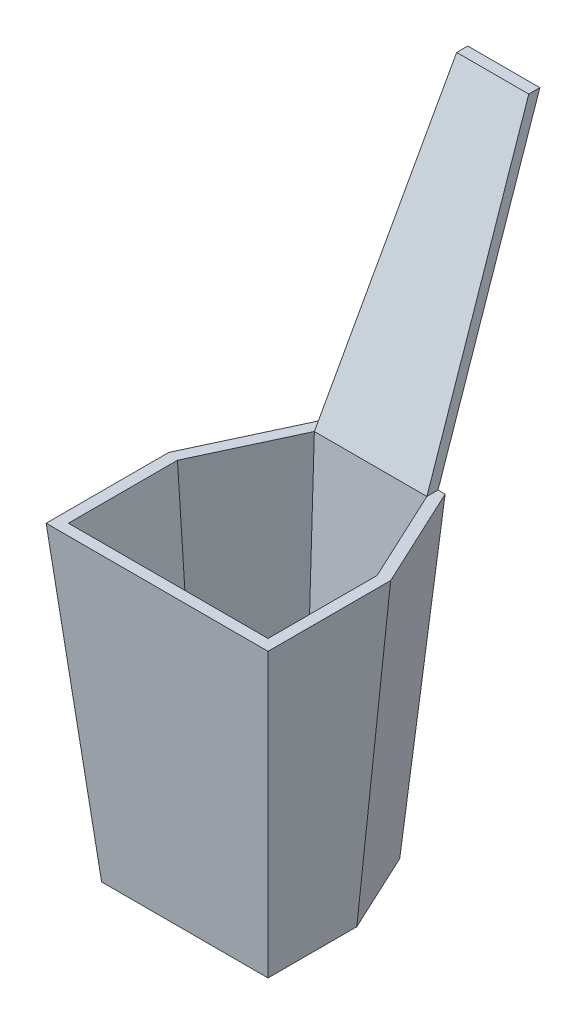
ISO-10303-21;
HEADER;
FILE_DESCRIPTION(('STEP AP214'),'2;1');
FILE_NAME('part.step','',(''),(''),'','','');
FILE_SCHEMA(('AUTOMOTIVE_DESIGN { 1 0 10303 214 1 1 1 1 }'));
ENDSEC;
DATA;
#1=APPLICATION_CONTEXT('core data for automotive mechanical design processes');
#2=APPLICATION_PROTOCOL_DEFINITION('international standard','automotive_design',2000,#1);
#3=PRODUCT_CONTEXT('',#1,'mechanical');
#4=PRODUCT('Part','Part','',(#3));
#5=PRODUCT_RELATED_PRODUCT_CATEGORY('part','',(#4));
#6=PRODUCT_DEFINITION_FORMATION('','',#4);
#7=PRODUCT_DEFINITION_CONTEXT('part definition',#1,'design');
#8=PRODUCT_DEFINITION('design','',#6,#7);
#9=PRODUCT_DEFINITION_SHAPE('','',#8);
#10=(LENGTH_UNIT() NAMED_UNIT(*) SI_UNIT(.MILLI.,.METRE.));
#11=(NAMED_UNIT(*) PLANE_ANGLE_UNIT() SI_UNIT($,.RADIAN.));
#12=(NAMED_UNIT(*) SI_UNIT($,.STERADIAN.) SOLID_ANGLE_UNIT());
#13=UNCERTAINTY_MEASURE_WITH_UNIT(LENGTH_MEASURE(1.E-05),#10,'distance_accuracy_value','');
#14=(GEOMETRIC_REPRESENTATION_CONTEXT(3) GLOBAL_UNCERTAINTY_ASSIGNED_CONTEXT((#13)) GLOBAL_UNIT_ASSIGNED_CONTEXT((#10,
#11,#12)) REPRESENTATION_CONTEXT('',''));
#15=CARTESIAN_POINT('',(0.,0.,0.));
#16=DIRECTION('',(0.,0.,1.));
#17=DIRECTION('',(1.,0.,0.));
#18=AXIS2_PLACEMENT_3D('',#15,#16,#17);
#19=CARTESIAN_POINT('',(0.,71.12,0.));
#20=DIRECTION('',(0.,-1.,0.));
#21=DIRECTION('',(0.,0.,-1.));
#22=AXIS2_PLACEMENT_3D('',#19,#20,#21);
#23=PLANE('',#22);
#24=DIRECTION('',(-0.422618261740697,0.,0.906307787036651));
#25=VECTOR('',#24,1.);
#26=CARTESIAN_POINT('',(-22.9829328482518,71.12,-10.7171175940018));
#27=LINE('',#26,#25);
#28=CARTESIAN_POINT('',(-12.8831974886377,71.12,-32.3760699680097));
#29=VERTEX_POINT('',#28);
#30=CARTESIAN_POINT('',(-22.8498957354249,71.12,-11.0024166031438));
#31=VERTEX_POINT('',#30);
#32=EDGE_CURVE('E208',#29,#31,#27,.T.);
#33=ORIENTED_EDGE('',*,*,#32,.F.);
#34=DIRECTION('',(0.,0.,1.));
#35=VECTOR('',#34,1.);
#36=CARTESIAN_POINT('',(-12.8831974886377,71.12,-32.3760699680097));
#37=LINE('',#36,#35);
#38=CARTESIAN_POINT('',(-12.8831974886377,71.12,-34.9261742325848));
#39=VERTEX_POINT('',#38);
#40=EDGE_CURVE('E170',#39,#29,#37,.T.);
#41=ORIENTED_EDGE('',*,*,#40,.F.);
#42=DIRECTION('',(-1.,0.,0.));
#43=VECTOR('',#42,1.);
#44=CARTESIAN_POINT('',(-14.5077930775568,71.12,-34.9261742325848));
#45=LINE('',#44,#43);
#46=CARTESIAN_POINT('',(-14.5077930775568,71.12,-34.9261742325848));
#47=VERTEX_POINT('',#46);
#48=EDGE_CURVE('E242',#39,#47,#45,.T.);
#49=ORIENTED_EDGE('',*,*,#48,.T.);
#50=DIRECTION('',(-0.422618261740703,0.,0.906307787036648));
#51=VECTOR('',#50,1.);
#52=CARTESIAN_POINT('',(-14.5077930775568,71.12,-34.9261742325848));
#53=LINE('',#52,#51);
#54=CARTESIAN_POINT('',(-25.4,71.12,-11.5677611077835));
#55=VERTEX_POINT('',#54);
#56=EDGE_CURVE('E373',#47,#55,#53,.T.);
#57=ORIENTED_EDGE('',*,*,#56,.T.);
#58=DIRECTION('',(0.,0.,1.));
#59=VECTOR('',#58,1.);
#60=CARTESIAN_POINT('',(-25.4,71.12,16.51));
#61=LINE('',#60,#59);
#62=CARTESIAN_POINT('',(-25.4,71.12,16.51));
#63=VERTEX_POINT('',#62);
#64=EDGE_CURVE('E354',#55,#63,#61,.T.);
#65=ORIENTED_EDGE('',*,*,#64,.T.);
#66=DIRECTION('',(1.,0.,0.));
#67=VECTOR('',#66,1.);
#68=CARTESIAN_POINT('',(25.4,71.12,16.51));
#69=LINE('',#68,#67);
#70=CARTESIAN_POINT('',(25.4,71.12,16.51));
#71=VERTEX_POINT('',#70);
#72=EDGE_CURVE('E483',#63,#71,#69,.T.);
#73=ORIENTED_EDGE('',*,*,#72,.T.);
#74=DIRECTION('',(0.,0.,-1.));
#75=VECTOR('',#74,1.);
#76=CARTESIAN_POINT('',(25.4,71.12,-11.5677611077827));
#77=LINE('',#76,#75);
#78=CARTESIAN_POINT('',(25.4,71.12,-11.5677611077827));
#79=VERTEX_POINT('',#78);
#80=EDGE_CURVE('E487',#71,#79,#77,.T.);
#81=ORIENTED_EDGE('',*,*,#80,.T.);
#82=DIRECTION('',(-0.422618261740691,0.,-0.906307787036654));
#83=VECTOR('',#82,1.);
#84=CARTESIAN_POINT('',(14.5077930775568,71.12,-34.9261742325848));
#85=LINE('',#84,#83);
#86=CARTESIAN_POINT('',(14.5077930775568,71.12,-34.9261742325848));
#87=VERTEX_POINT('',#86);
#88=EDGE_CURVE('E518',#79,#87,#85,.T.);
#89=ORIENTED_EDGE('',*,*,#88,.T.);
#90=CARTESIAN_POINT('',(12.8831974886375,71.12,-34.9261742325848));
#91=VERTEX_POINT('',#90);
#92=EDGE_CURVE('E508',#87,#91,#45,.T.);
#93=ORIENTED_EDGE('',*,*,#92,.T.);
#94=DIRECTION('',(0.,0.,-1.));
#95=VECTOR('',#94,1.);
#96=CARTESIAN_POINT('',(12.8831974886375,71.12,-32.3760699680097));
#97=LINE('',#96,#95);
#98=CARTESIAN_POINT('',(12.8831974886375,71.12,-32.3760699680097));
#99=VERTEX_POINT('',#98);
#100=EDGE_CURVE('E744',#99,#91,#97,.T.);
#101=ORIENTED_EDGE('',*,*,#100,.F.);
#102=DIRECTION('',(-0.422618261740697,0.,-0.906307787036651));
#103=VECTOR('',#102,1.);
#104=CARTESIAN_POINT('',(22.9829328482517,71.12,-10.7171175940018));
#105=LINE('',#104,#103);
#106=CARTESIAN_POINT('',(22.8498957354249,71.12,-11.0024166031434));
#107=VERTEX_POINT('',#106);
#108=EDGE_CURVE('E201',#107,#99,#105,.T.);
#109=ORIENTED_EDGE('',*,*,#108,.F.);
#110=DIRECTION('',(0.,0.,-1.));
#111=VECTOR('',#110,1.);
#112=CARTESIAN_POINT('',(22.8498957354249,71.12,0.));
#113=LINE('',#112,#111);
#114=CARTESIAN_POINT('',(22.8498957354249,71.12,13.9598957354249));
#115=VERTEX_POINT('',#114);
#116=EDGE_CURVE('E236',#115,#107,#113,.T.);
#117=ORIENTED_EDGE('',*,*,#116,.F.);
#118=DIRECTION('',(1.,0.,0.));
#119=VECTOR('',#118,1.);
#120=CARTESIAN_POINT('',(0.,71.12,13.9598957354249));
#121=LINE('',#120,#119);
#122=CARTESIAN_POINT('',(-22.8498957354249,71.12,13.9598957354249));
#123=VERTEX_POINT('',#122);
#124=EDGE_CURVE('E219',#123,#115,#121,.T.);
#125=ORIENTED_EDGE('',*,*,#124,.F.);
#126=DIRECTION('',(0.,0.,1.));
#127=VECTOR('',#126,1.);
#128=CARTESIAN_POINT('',(-22.8498957354249,71.12,0.));
#129=LINE('',#128,#127);
#130=EDGE_CURVE('E216',#31,#123,#129,.T.);
#131=ORIENTED_EDGE('',*,*,#130,.F.);
#132=EDGE_LOOP('',(#33,#41,#49,#57,#65,#73,#81,#89,#93,#101,#109,#117,#125,#131));
#133=FACE_BOUND('',#132,.T.);
#134=ADVANCED_FACE('F55',(#133),#23,.F.);
#135=CARTESIAN_POINT('',(0.,0.,0.));
#136=DIRECTION('',(0.,-1.,0.));
#137=DIRECTION('',(0.,0.,-1.));
#138=AXIS2_PLACEMENT_3D('',#135,#136,#137);
#139=PLANE('',#138);
#140=DIRECTION('',(-0.422618261740697,0.,0.906307787036651));
#141=VECTOR('',#140,1.);
#142=CARTESIAN_POINT('',(-19.05,0.,-10.16));
#143=LINE('',#142,#141);
#144=CARTESIAN_POINT('',(-10.462396921429,0.,-28.5761742325848));
#145=VERTEX_POINT('',#144);
#146=CARTESIAN_POINT('',(-19.05,0.,-10.16));
#147=VERTEX_POINT('',#146);
#148=EDGE_CURVE('E396',#145,#147,#143,.T.);
#149=ORIENTED_EDGE('',*,*,#148,.F.);
#150=DIRECTION('',(-1.,0.,0.));
#151=VECTOR('',#150,1.);
#152=CARTESIAN_POINT('',(-10.462396921429,0.,-28.5761742325848));
#153=LINE('',#152,#151);
#154=CARTESIAN_POINT('',(10.462396921429,0.,-28.5761742325848));
#155=VERTEX_POINT('',#154);
#156=EDGE_CURVE('E406',#155,#145,#153,.T.);
#157=ORIENTED_EDGE('',*,*,#156,.F.);
#158=DIRECTION('',(-0.422618261740697,0.,-0.906307787036651));
#159=VECTOR('',#158,1.);
#160=CARTESIAN_POINT('',(10.462396921429,0.,-28.5761742325848));
#161=LINE('',#160,#159);
#162=CARTESIAN_POINT('',(19.05,0.,-10.16));
#163=VERTEX_POINT('',#162);
#164=EDGE_CURVE('E288',#163,#155,#161,.T.);
#165=ORIENTED_EDGE('',*,*,#164,.F.);
#166=DIRECTION('',(0.,0.,-1.));
#167=VECTOR('',#166,1.);
#168=CARTESIAN_POINT('',(19.05,0.,-10.16));
#169=LINE('',#168,#167);
#170=CARTESIAN_POINT('',(19.05,0.,10.16));
#171=VERTEX_POINT('',#170);
#172=EDGE_CURVE('E303',#171,#163,#169,.T.);
#173=ORIENTED_EDGE('',*,*,#172,.F.);
#174=DIRECTION('',(1.,0.,0.));
#175=VECTOR('',#174,1.);
#176=CARTESIAN_POINT('',(19.05,0.,10.16));
#177=LINE('',#176,#175);
#178=CARTESIAN_POINT('',(-19.05,0.,10.16));
#179=VERTEX_POINT('',#178);
#180=EDGE_CURVE('E66',#179,#171,#177,.T.);
#181=ORIENTED_EDGE('',*,*,#180,.F.);
#182=DIRECTION('',(0.,0.,1.));
#183=VECTOR('',#182,1.);
#184=CARTESIAN_POINT('',(-19.05,0.,10.16));
#185=LINE('',#184,#183);
#186=EDGE_CURVE('E12',#147,#179,#185,.T.);
#187=ORIENTED_EDGE('',*,*,#186,.F.);
#188=EDGE_LOOP('',(#149,#157,#165,#173,#181,#187));
#189=FACE_BOUND('',#188,.T.);
#190=ADVANCED_FACE('F57',(#189),#139,.T.);
#191=CARTESIAN_POINT('',(19.384525502808,-1.90968369726461,-9.03915269166019));
#192=DIRECTION('',(0.902716728508614,-0.0889319379745055,-0.42094372364819));
#193=DIRECTION('',(-0.422618261740697,0.,-0.906307787036651));
#194=AXIS2_PLACEMENT_3D('',#191,#192,#193);
#195=PLANE('',#194);
#196=DIRECTION('',(-0.0889146586341123,-0.995844176702057,0.0197119052499014));
#197=VECTOR('',#196,1.);
#198=CARTESIAN_POINT('',(25.4,71.12,-11.5677611077827));
#199=LINE('',#198,#197);
#200=EDGE_CURVE('E493',#79,#163,#199,.T.);
#201=ORIENTED_EDGE('',*,*,#200,.T.);
#202=ORIENTED_EDGE('',*,*,#164,.T.);
#203=DIRECTION('',(-0.0565651816433449,-0.994442957676953,0.0887895497925851));
#204=VECTOR('',#203,1.);
#205=CARTESIAN_POINT('',(14.5077930775568,71.12,-34.9261742325848));
#206=LINE('',#205,#204);
#207=EDGE_CURVE('E252',#87,#155,#206,.T.);
#208=ORIENTED_EDGE('',*,*,#207,.F.);
#209=ORIENTED_EDGE('',*,*,#88,.F.);
#210=EDGE_LOOP('',(#201,#202,#208,#209));
#211=FACE_BOUND('',#210,.T.);
#212=ADVANCED_FACE('F267',(#211),#195,.T.);
#213=CARTESIAN_POINT('',(0.,-2.53126503800181,-28.3501684256203));
#214=DIRECTION('',(0.,-0.0889319379745056,-0.996037705314462));
#215=DIRECTION('',(0.,0.996037705314462,-0.0889319379745056));
#216=AXIS2_PLACEMENT_3D('',#213,#214,#215);
#217=PLANE('',#216);
#218=ORIENTED_EDGE('',*,*,#207,.T.);
#219=ORIENTED_EDGE('',*,*,#156,.T.);
#220=DIRECTION('',(0.0565651816433446,-0.994442957676953,0.0887895497925851));
#221=VECTOR('',#220,1.);
#222=CARTESIAN_POINT('',(-14.5077930775568,71.12,-34.9261742325848));
#223=LINE('',#222,#221);
#224=EDGE_CURVE('E365',#47,#145,#223,.T.);
#225=ORIENTED_EDGE('',*,*,#224,.F.);
#226=ORIENTED_EDGE('',*,*,#48,.F.);
#227=DIRECTION('',(-1.,0.,0.));
#228=VECTOR('',#227,1.);
#229=CARTESIAN_POINT('',(-12.8831974886377,71.12,-34.9261742325848));
#230=LINE('',#229,#228);
#231=EDGE_CURVE('E180',#91,#39,#230,.T.);
#232=ORIENTED_EDGE('',*,*,#231,.F.);
#233=ORIENTED_EDGE('',*,*,#92,.F.);
#234=EDGE_LOOP('',(#218,#219,#225,#226,#232,#233));
#235=FACE_BOUND('',#234,.T.);
#236=ADVANCED_FACE('F256',(#235),#217,.T.);
#237=CARTESIAN_POINT('',(18.8993356532743,-1.68744068332806,0.));
#238=DIRECTION('',(0.996037705314462,-0.0889319379745055,0.));
#239=DIRECTION('',(0.0889319379745055,0.996037705314462,0.));
#240=AXIS2_PLACEMENT_3D('',#237,#238,#239);
#241=PLANE('',#240);
#242=DIRECTION('',(-0.088582333908789,-0.992122139778436,-0.088582333908789));
#243=VECTOR('',#242,1.);
#244=CARTESIAN_POINT('',(25.4,71.12,16.51));
#245=LINE('',#244,#243);
#246=EDGE_CURVE('E346',#71,#171,#245,.T.);
#247=ORIENTED_EDGE('',*,*,#246,.T.);
#248=ORIENTED_EDGE('',*,*,#172,.T.);
#249=ORIENTED_EDGE('',*,*,#200,.F.);
#250=ORIENTED_EDGE('',*,*,#80,.F.);
#251=EDGE_LOOP('',(#247,#248,#249,#250));
#252=FACE_BOUND('',#251,.T.);
#253=ADVANCED_FACE('F266',(#252),#241,.T.);
#254=CARTESIAN_POINT('',(0.,-0.899968364441633,10.0796456817463));
#255=DIRECTION('',(0.,-0.0889319379745055,0.996037705314462));
#256=DIRECTION('',(0.,-0.996037705314462,-0.0889319379745055));
#257=AXIS2_PLACEMENT_3D('',#254,#255,#256);
#258=PLANE('',#257);
#259=DIRECTION('',(0.0885823339087889,-0.992122139778436,-0.088582333908789));
#260=VECTOR('',#259,1.);
#261=CARTESIAN_POINT('',(-25.4,71.12,16.51));
#262=LINE('',#261,#260);
#263=EDGE_CURVE('E338',#63,#179,#262,.T.);
#264=ORIENTED_EDGE('',*,*,#263,.T.);
#265=ORIENTED_EDGE('',*,*,#180,.T.);
#266=ORIENTED_EDGE('',*,*,#246,.F.);
#267=ORIENTED_EDGE('',*,*,#72,.F.);
#268=EDGE_LOOP('',(#264,#265,#266,#267));
#269=FACE_BOUND('',#268,.T.);
#270=ADVANCED_FACE('F320',(#269),#258,.T.);
#271=CARTESIAN_POINT('',(-18.8993356532743,-1.68744068332806,0.));
#272=DIRECTION('',(-0.996037705314462,-0.0889319379745053,0.));
#273=DIRECTION('',(0.0889319379745054,-0.996037705314462,0.));
#274=AXIS2_PLACEMENT_3D('',#271,#272,#273);
#275=PLANE('',#274);
#276=DIRECTION('',(0.0889146586341121,-0.995844176702057,0.019711905249913));
#277=VECTOR('',#276,1.);
#278=CARTESIAN_POINT('',(-25.4,71.12,-11.5677611077835));
#279=LINE('',#278,#277);
#280=EDGE_CURVE('E345',#55,#147,#279,.T.);
#281=ORIENTED_EDGE('',*,*,#280,.T.);
#282=ORIENTED_EDGE('',*,*,#186,.T.);
#283=ORIENTED_EDGE('',*,*,#263,.F.);
#284=ORIENTED_EDGE('',*,*,#64,.F.);
#285=EDGE_LOOP('',(#281,#282,#283,#284));
#286=FACE_BOUND('',#285,.T.);
#287=ADVANCED_FACE('F329',(#286),#275,.T.);
#288=CARTESIAN_POINT('',(-19.384525502808,-1.90968369726466,-9.03915269166019));
#289=DIRECTION('',(-0.902716728508614,-0.0889319379745077,-0.42094372364819));
#290=DIRECTION('',(-0.422618261740697,0.,0.906307787036651));
#291=AXIS2_PLACEMENT_3D('',#288,#289,#290);
#292=PLANE('',#291);
#293=ORIENTED_EDGE('',*,*,#224,.T.);
#294=ORIENTED_EDGE('',*,*,#148,.T.);
#295=ORIENTED_EDGE('',*,*,#280,.F.);
#296=ORIENTED_EDGE('',*,*,#56,.F.);
#297=EDGE_LOOP('',(#293,#294,#295,#296));
#298=FACE_BOUND('',#297,.T.);
#299=ADVANCED_FACE('F378',(#298),#292,.T.);
#300=CARTESIAN_POINT('',(0.,2.54,0.));
#301=DIRECTION('',(0.,-1.,0.));
#302=DIRECTION('',(0.,0.,-1.));
#303=AXIS2_PLACEMENT_3D('',#300,#301,#302);
#304=PLANE('',#303);
#305=DIRECTION('',(-0.422618261740697,0.,0.906307787036651));
#306=VECTOR('',#305,1.);
#307=CARTESIAN_POINT('',(-17.4334160594148,2.54,-8.12933541630739));
#308=LINE('',#307,#306);
#309=CARTESIAN_POINT('',(-8.98227976665731,2.54,-26.2528556822954));
#310=VERTEX_POINT('',#309);
#311=CARTESIAN_POINT('',(-16.7266814497106,2.54,-9.64493267778153));
#312=VERTEX_POINT('',#311);
#313=EDGE_CURVE('E211',#310,#312,#308,.T.);
#314=ORIENTED_EDGE('',*,*,#313,.T.);
#315=DIRECTION('',(0.,0.,1.));
#316=VECTOR('',#315,1.);
#317=CARTESIAN_POINT('',(-16.7266814497106,2.54,0.));
#318=LINE('',#317,#316);
#319=CARTESIAN_POINT('',(-16.7266814497106,2.54,7.83668144971062));
#320=VERTEX_POINT('',#319);
#321=EDGE_CURVE('E757',#312,#320,#318,.T.);
#322=ORIENTED_EDGE('',*,*,#321,.T.);
#323=DIRECTION('',(1.,0.,0.));
#324=VECTOR('',#323,1.);
#325=CARTESIAN_POINT('',(0.,2.54,7.83668144971062));
#326=LINE('',#325,#324);
#327=CARTESIAN_POINT('',(16.7266814497106,2.54,7.83668144971062));
#328=VERTEX_POINT('',#327);
#329=EDGE_CURVE('E759',#320,#328,#326,.T.);
#330=ORIENTED_EDGE('',*,*,#329,.T.);
#331=DIRECTION('',(0.,0.,-1.));
#332=VECTOR('',#331,1.);
#333=CARTESIAN_POINT('',(16.7266814497106,2.54,0.));
#334=LINE('',#333,#332);
#335=CARTESIAN_POINT('',(16.7266814497106,2.54,-9.64493267778151));
#336=VERTEX_POINT('',#335);
#337=EDGE_CURVE('E764',#328,#336,#334,.T.);
#338=ORIENTED_EDGE('',*,*,#337,.T.);
#339=DIRECTION('',(-0.422618261740697,0.,-0.906307787036651));
#340=VECTOR('',#339,1.);
#341=CARTESIAN_POINT('',(17.4334160594147,2.54,-8.12933541630738));
#342=LINE('',#341,#340);
#343=CARTESIAN_POINT('',(8.98227976665728,2.54,-26.2528556822954));
#344=VERTEX_POINT('',#343);
#345=EDGE_CURVE('E781',#336,#344,#342,.T.);
#346=ORIENTED_EDGE('',*,*,#345,.T.);
#347=DIRECTION('',(-1.,0.,0.));
#348=VECTOR('',#347,1.);
#349=CARTESIAN_POINT('',(0.,2.54,-26.2528556822954));
#350=LINE('',#349,#348);
#351=EDGE_CURVE('E782',#344,#310,#350,.T.);
#352=ORIENTED_EDGE('',*,*,#351,.T.);
#353=EDGE_LOOP('',(#314,#322,#330,#338,#346,#352));
#354=FACE_BOUND('',#353,.T.);
#355=ADVANCED_FACE('F386',(#354),#304,.F.);
#356=CARTESIAN_POINT('',(17.0916250123961,-1.68379657480937,-7.96995563359379));
#357=DIRECTION('',(0.902716728508614,-0.0889319379745055,-0.42094372364819));
#358=DIRECTION('',(-0.422618261740697,0.,-0.906307787036651));
#359=AXIS2_PLACEMENT_3D('',#356,#357,#358);
#360=PLANE('',#359);
#361=DIRECTION('',(-0.0889146586341123,-0.995844176702057,0.0197119052499015));
#362=VECTOR('',#361,1.);
#363=CARTESIAN_POINT('',(16.3526342520006,-1.64932861435261,-9.56200841047264));
#364=LINE('',#363,#362);
#365=EDGE_CURVE('E200',#107,#336,#364,.T.);
#366=ORIENTED_EDGE('',*,*,#365,.F.);
#367=ORIENTED_EDGE('',*,*,#108,.T.);
#368=DIRECTION('',(-0.0565651816433422,-0.994442957676953,0.0887895497925851));
#369=VECTOR('',#368,1.);
#370=CARTESIAN_POINT('',(8.67881047256195,-2.79513538924195,-25.7765043082559));
#371=LINE('',#370,#369);
#372=EDGE_CURVE('E199',#99,#344,#371,.T.);
#373=ORIENTED_EDGE('',*,*,#372,.T.);
#374=ORIENTED_EDGE('',*,*,#345,.F.);
#375=EDGE_LOOP('',(#366,#367,#373,#374));
#376=FACE_BOUND('',#375,.T.);
#377=ADVANCED_FACE('F549',(#376),#360,.F.);
#378=CARTESIAN_POINT('',(0.,-2.30537791554657,-25.8202326541216));
#379=DIRECTION('',(0.,-0.0889319379745056,-0.996037705314462));
#380=DIRECTION('',(0.,0.996037705314462,-0.0889319379745056));
#381=AXIS2_PLACEMENT_3D('',#378,#379,#380);
#382=PLANE('',#381);
#383=ORIENTED_EDGE('',*,*,#372,.F.);
#384=DIRECTION('',(-1.,0.,0.));
#385=VECTOR('',#384,1.);
#386=CARTESIAN_POINT('',(0.,71.12,-32.3760699680097));
#387=LINE('',#386,#385);
#388=EDGE_CURVE('E60',#99,#29,#387,.T.);
#389=ORIENTED_EDGE('',*,*,#388,.T.);
#390=DIRECTION('',(0.0565651816433446,-0.994442957676953,0.0887895497925851));
#391=VECTOR('',#390,1.);
#392=CARTESIAN_POINT('',(-8.67881047256197,-2.79513538924197,-25.7765043082559));
#393=LINE('',#392,#391);
#394=EDGE_CURVE('E196',#29,#310,#393,.T.);
#395=ORIENTED_EDGE('',*,*,#394,.T.);
#396=ORIENTED_EDGE('',*,*,#351,.F.);
#397=EDGE_LOOP('',(#383,#389,#395,#396));
#398=FACE_BOUND('',#397,.T.);
#399=ADVANCED_FACE('F194',(#398),#382,.F.);
#400=CARTESIAN_POINT('',(16.3693998817755,-1.46155356087282,0.));
#401=DIRECTION('',(0.996037705314462,-0.0889319379745055,0.));
#402=DIRECTION('',(0.0889319379745055,0.996037705314462,0.));
#403=AXIS2_PLACEMENT_3D('',#400,#401,#402);
#404=PLANE('',#403);
#405=DIRECTION('',(-0.088582333908789,-0.992122139778437,-0.088582333908789));
#406=VECTOR('',#405,1.);
#407=CARTESIAN_POINT('',(16.3107103032933,-2.11887683987381,7.42071030329332));
#408=LINE('',#407,#406);
#409=EDGE_CURVE('E231',#115,#328,#408,.T.);
#410=ORIENTED_EDGE('',*,*,#409,.F.);
#411=ORIENTED_EDGE('',*,*,#116,.T.);
#412=ORIENTED_EDGE('',*,*,#365,.T.);
#413=ORIENTED_EDGE('',*,*,#337,.F.);
#414=EDGE_LOOP('',(#410,#411,#412,#413));
#415=FACE_BOUND('',#414,.T.);
#416=ADVANCED_FACE('F565',(#415),#404,.F.);
#417=CARTESIAN_POINT('',(0.,-0.674081241986389,7.54970991024755));
#418=DIRECTION('',(0.,-0.0889319379745055,0.996037705314462));
#419=DIRECTION('',(0.,-0.996037705314462,-0.0889319379745055));
#420=AXIS2_PLACEMENT_3D('',#417,#418,#419);
#421=PLANE('',#420);
#422=DIRECTION('',(0.0885823339087888,-0.992122139778437,-0.088582333908789));
#423=VECTOR('',#422,1.);
#424=CARTESIAN_POINT('',(-16.3107103032933,-2.1188768398738,7.42071030329332));
#425=LINE('',#424,#423);
#426=EDGE_CURVE('E771',#123,#320,#425,.T.);
#427=ORIENTED_EDGE('',*,*,#426,.F.);
#428=ORIENTED_EDGE('',*,*,#124,.T.);
#429=ORIENTED_EDGE('',*,*,#409,.T.);
#430=ORIENTED_EDGE('',*,*,#329,.F.);
#431=EDGE_LOOP('',(#427,#428,#429,#430));
#432=FACE_BOUND('',#431,.T.);
#433=ADVANCED_FACE('F572',(#432),#421,.F.);
#434=CARTESIAN_POINT('',(-16.3693998817756,-1.46155356087281,0.));
#435=DIRECTION('',(-0.996037705314462,-0.0889319379745053,0.));
#436=DIRECTION('',(0.0889319379745054,-0.996037705314462,0.));
#437=AXIS2_PLACEMENT_3D('',#434,#435,#436);
#438=PLANE('',#437);
#439=DIRECTION('',(0.0889146586341121,-0.995844176702057,0.0197119052499071));
#440=VECTOR('',#439,1.);
#441=CARTESIAN_POINT('',(-16.3526342520006,-1.64932861435266,-9.56200841047264));
#442=LINE('',#441,#440);
#443=EDGE_CURVE('E212',#31,#312,#442,.T.);
#444=ORIENTED_EDGE('',*,*,#443,.F.);
#445=ORIENTED_EDGE('',*,*,#130,.T.);
#446=ORIENTED_EDGE('',*,*,#426,.T.);
#447=ORIENTED_EDGE('',*,*,#321,.F.);
#448=EDGE_LOOP('',(#444,#445,#446,#447));
#449=FACE_BOUND('',#448,.T.);
#450=ADVANCED_FACE('F580',(#449),#438,.F.);
#451=CARTESIAN_POINT('',(-17.0916250123961,-1.68379657480941,-7.96995563359379));
#452=DIRECTION('',(-0.902716728508614,-0.0889319379745077,-0.42094372364819));
#453=DIRECTION('',(-0.422618261740697,0.,0.906307787036651));
#454=AXIS2_PLACEMENT_3D('',#451,#452,#453);
#455=PLANE('',#454);
#456=ORIENTED_EDGE('',*,*,#394,.F.);
#457=ORIENTED_EDGE('',*,*,#32,.T.);
#458=ORIENTED_EDGE('',*,*,#443,.T.);
#459=ORIENTED_EDGE('',*,*,#313,.F.);
#460=EDGE_LOOP('',(#456,#457,#458,#459));
#461=FACE_BOUND('',#460,.T.);
#462=ADVANCED_FACE('F206',(#461),#455,.F.);
#463=CARTESIAN_POINT('',(0.,134.62,0.));
#464=DIRECTION('',(0.,1.,0.));
#465=DIRECTION('',(0.,0.,1.));
#466=AXIS2_PLACEMENT_3D('',#463,#464,#465);
#467=PLANE('',#466);
#468=DIRECTION('',(0.,0.,1.));
#469=VECTOR('',#468,1.);
#470=CARTESIAN_POINT('',(-8.255,134.62,-62.8661742325848));
#471=LINE('',#470,#469);
#472=CARTESIAN_POINT('',(-8.255,134.62,-62.8661742325848));
#473=VERTEX_POINT('',#472);
#474=CARTESIAN_POINT('',(-8.255,134.62,-60.3261742325848));
#475=VERTEX_POINT('',#474);
#476=EDGE_CURVE('E733',#473,#475,#471,.T.);
#477=ORIENTED_EDGE('',*,*,#476,.T.);
#478=DIRECTION('',(1.,0.,0.));
#479=VECTOR('',#478,1.);
#480=CARTESIAN_POINT('',(-8.255,134.62,-60.3261742325848));
#481=LINE('',#480,#479);
#482=CARTESIAN_POINT('',(8.255,134.62,-60.3261742325848));
#483=VERTEX_POINT('',#482);
#484=EDGE_CURVE('E184',#475,#483,#481,.T.);
#485=ORIENTED_EDGE('',*,*,#484,.T.);
#486=DIRECTION('',(0.,0.,-1.));
#487=VECTOR('',#486,1.);
#488=CARTESIAN_POINT('',(8.255,134.62,-60.3261742325848));
#489=LINE('',#488,#487);
#490=CARTESIAN_POINT('',(8.255,134.62,-62.8661742325848));
#491=VERTEX_POINT('',#490);
#492=EDGE_CURVE('E221',#483,#491,#489,.T.);
#493=ORIENTED_EDGE('',*,*,#492,.T.);
#494=DIRECTION('',(-1.,0.,0.));
#495=VECTOR('',#494,1.);
#496=CARTESIAN_POINT('',(-8.255,134.62,-62.8661742325848));
#497=LINE('',#496,#495);
#498=EDGE_CURVE('E217',#491,#473,#497,.T.);
#499=ORIENTED_EDGE('',*,*,#498,.T.);
#500=EDGE_LOOP('',(#477,#485,#493,#499));
#501=FACE_BOUND('',#500,.T.);
#502=ADVANCED_FACE('F594',(#501),#467,.T.);
#503=CARTESIAN_POINT('',(0.,-1.3393805817169,-3.04404677662932));
#504=DIRECTION('',(0.,0.402738614266017,0.915315032422766));
#505=DIRECTION('',(0.,-0.915315032422766,0.402738614266017));
#506=AXIS2_PLACEMENT_3D('',#503,#504,#505);
#507=PLANE('',#506);
#508=DIRECTION('',(0.066564774190263,0.913284960604806,-0.401845382666115));
#509=VECTOR('',#508,1.);
#510=CARTESIAN_POINT('',(-12.8831974886377,71.12,-34.9261742325848));
#511=LINE('',#510,#509);
#512=EDGE_CURVE('E176',#39,#473,#511,.T.);
#513=ORIENTED_EDGE('',*,*,#512,.T.);
#514=ORIENTED_EDGE('',*,*,#498,.F.);
#515=DIRECTION('',(-0.0665647741902602,0.913284960604807,-0.401845382666115));
#516=VECTOR('',#515,1.);
#517=CARTESIAN_POINT('',(12.8831974886375,71.12,-34.9261742325848));
#518=LINE('',#517,#516);
#519=EDGE_CURVE('E187',#91,#491,#518,.T.);
#520=ORIENTED_EDGE('',*,*,#519,.F.);
#521=ORIENTED_EDGE('',*,*,#231,.T.);
#522=EDGE_LOOP('',(#513,#514,#520,#521));
#523=FACE_BOUND('',#522,.T.);
#524=ADVANCED_FACE('F600',(#523),#507,.F.);
#525=CARTESIAN_POINT('',(17.9713110603815,1.30983900342016,0.));
#526=DIRECTION('',(-0.997354424163806,-0.0726921770267147,0.));
#527=DIRECTION('',(0.0726921770267147,-0.997354424163806,0.));
#528=AXIS2_PLACEMENT_3D('',#525,#526,#527);
#529=PLANE('',#528);
#530=ORIENTED_EDGE('',*,*,#519,.T.);
#531=ORIENTED_EDGE('',*,*,#492,.F.);
#532=DIRECTION('',(-0.0665608865935086,0.913231621827813,-0.401967229099124));
#533=VECTOR('',#532,1.);
#534=CARTESIAN_POINT('',(12.8831974886375,71.12,-32.3760699680097));
#535=LINE('',#534,#533);
#536=EDGE_CURVE('E186',#99,#483,#535,.T.);
#537=ORIENTED_EDGE('',*,*,#536,.F.);
#538=ORIENTED_EDGE('',*,*,#100,.T.);
#539=EDGE_LOOP('',(#530,#531,#537,#538));
#540=FACE_BOUND('',#539,.T.);
#541=ADVANCED_FACE('F608',(#540),#529,.F.);
#542=CARTESIAN_POINT('',(-17.9713110603819,1.30983900342025,0.));
#543=DIRECTION('',(0.997354424163806,-0.0726921770267177,0.));
#544=DIRECTION('',(0.0726921770267177,0.997354424163806,0.));
#545=AXIS2_PLACEMENT_3D('',#542,#543,#544);
#546=PLANE('',#545);
#547=DIRECTION('',(0.0665608865935114,0.913231621827813,-0.401967229099124));
#548=VECTOR('',#547,1.);
#549=CARTESIAN_POINT('',(-12.8831974886377,71.12,-32.3760699680097));
#550=LINE('',#549,#548);
#551=EDGE_CURVE('E173',#29,#475,#550,.T.);
#552=ORIENTED_EDGE('',*,*,#551,.T.);
#553=ORIENTED_EDGE('',*,*,#476,.F.);
#554=ORIENTED_EDGE('',*,*,#512,.F.);
#555=ORIENTED_EDGE('',*,*,#40,.T.);
#556=EDGE_LOOP('',(#552,#553,#554,#555));
#557=FACE_BOUND('',#556,.T.);
#558=ADVANCED_FACE('F171',(#557),#546,.F.);
#559=CARTESIAN_POINT('',(0.,-0.395253535154998,-0.897978742574967));
#560=DIRECTION('',(0.,-0.402860626830242,-0.915261337187333));
#561=DIRECTION('',(0.,0.915261337187333,-0.402860626830242));
#562=AXIS2_PLACEMENT_3D('',#559,#560,#561);
#563=PLANE('',#562);
#564=ORIENTED_EDGE('',*,*,#536,.T.);
#565=ORIENTED_EDGE('',*,*,#484,.F.);
#566=ORIENTED_EDGE('',*,*,#551,.F.);
#567=ORIENTED_EDGE('',*,*,#388,.F.);
#568=EDGE_LOOP('',(#564,#565,#566,#567));
#569=FACE_BOUND('',#568,.T.);
#570=ADVANCED_FACE('F182',(#569),#563,.F.);
#571=CLOSED_SHELL('',(#134,#190,#212,#236,#253,#270,#287,#299,#355,#377,#399,#416,#433,#450,
#462,#502,#524,#541,#558,#570));
#572=MANIFOLD_SOLID_BREP('B2',#571);
#573=ADVANCED_BREP_SHAPE_REPRESENTATION('',(#18,#572),#14);
#574=SHAPE_DEFINITION_REPRESENTATION(#9,#573);
ENDSEC;
END-ISO-10303-21;
